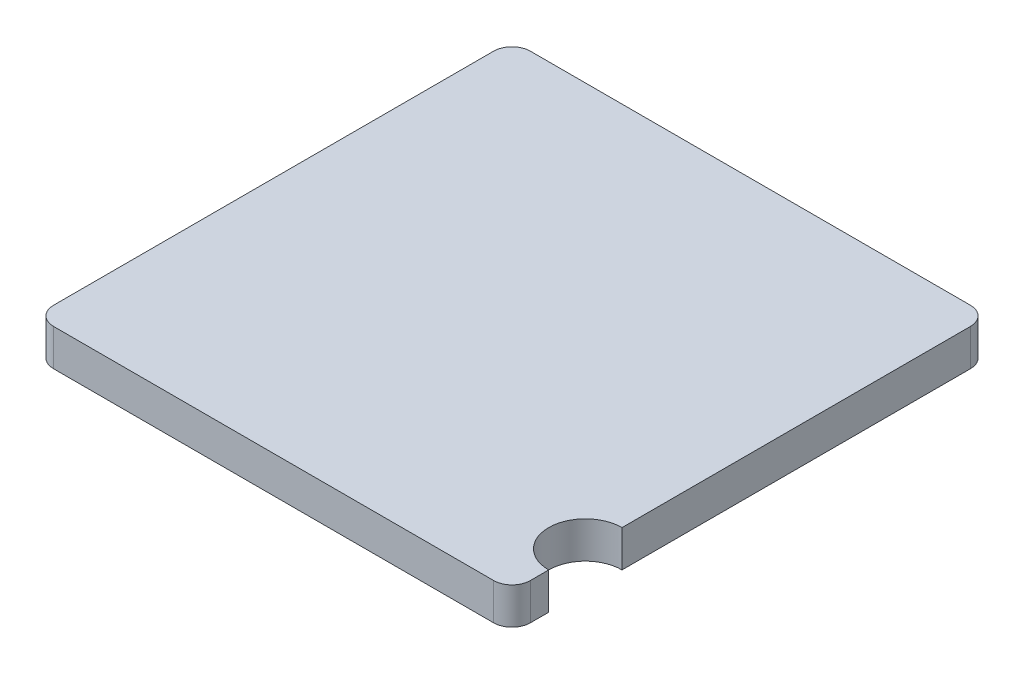
ISO-10303-21;
HEADER;
FILE_DESCRIPTION(('STEP AP214'),'2;1');
FILE_NAME('part.step','',(''),(''),'','','');
FILE_SCHEMA(('AUTOMOTIVE_DESIGN { 1 0 10303 214 1 1 1 1 }'));
ENDSEC;
DATA;
#1=APPLICATION_CONTEXT('core data for automotive mechanical design processes');
#2=APPLICATION_PROTOCOL_DEFINITION('international standard','automotive_design',2000,#1);
#3=PRODUCT_CONTEXT('',#1,'mechanical');
#4=PRODUCT('Part','Part','',(#3));
#5=PRODUCT_RELATED_PRODUCT_CATEGORY('part','',(#4));
#6=PRODUCT_DEFINITION_FORMATION('','',#4);
#7=PRODUCT_DEFINITION_CONTEXT('part definition',#1,'design');
#8=PRODUCT_DEFINITION('design','',#6,#7);
#9=PRODUCT_DEFINITION_SHAPE('','',#8);
#10=(LENGTH_UNIT() NAMED_UNIT(*) SI_UNIT(.MILLI.,.METRE.));
#11=(NAMED_UNIT(*) PLANE_ANGLE_UNIT() SI_UNIT($,.RADIAN.));
#12=(NAMED_UNIT(*) SI_UNIT($,.STERADIAN.) SOLID_ANGLE_UNIT());
#13=UNCERTAINTY_MEASURE_WITH_UNIT(LENGTH_MEASURE(1.E-05),#10,'distance_accuracy_value','');
#14=(GEOMETRIC_REPRESENTATION_CONTEXT(3) GLOBAL_UNCERTAINTY_ASSIGNED_CONTEXT((#13)) GLOBAL_UNIT_ASSIGNED_CONTEXT((#10,
#11,#12)) REPRESENTATION_CONTEXT('',''));
#15=CARTESIAN_POINT('',(0.,0.,0.));
#16=DIRECTION('',(0.,0.,1.));
#17=DIRECTION('',(1.,0.,0.));
#18=AXIS2_PLACEMENT_3D('',#15,#16,#17);
#19=CARTESIAN_POINT('',(1.3,0.2,-1.3));
#20=DIRECTION('',(-1.,0.,0.));
#21=DIRECTION('',(0.,0.,1.));
#22=AXIS2_PLACEMENT_3D('',#19,#20,#21);
#23=PLANE('',#22);
#24=DIRECTION('',(0.,0.,-1.));
#25=VECTOR('',#24,1.);
#26=CARTESIAN_POINT('',(1.3,0.2,-1.3));
#27=LINE('',#26,#25);
#28=CARTESIAN_POINT('',(1.3,0.2,0.7));
#29=VERTEX_POINT('',#28);
#30=CARTESIAN_POINT('',(1.3,0.2,-1.2));
#31=VERTEX_POINT('',#30);
#32=EDGE_CURVE('E128',#29,#31,#27,.T.);
#33=ORIENTED_EDGE('',*,*,#32,.F.);
#34=DIRECTION('',(0.,-1.,0.));
#35=VECTOR('',#34,1.);
#36=CARTESIAN_POINT('',(1.3,0.2,0.7));
#37=LINE('',#36,#35);
#38=CARTESIAN_POINT('',(1.3,0.,0.7));
#39=VERTEX_POINT('',#38);
#40=EDGE_CURVE('E115',#29,#39,#37,.T.);
#41=ORIENTED_EDGE('',*,*,#40,.T.);
#42=DIRECTION('',(0.,0.,-1.));
#43=VECTOR('',#42,1.);
#44=CARTESIAN_POINT('',(1.3,0.,-1.3));
#45=LINE('',#44,#43);
#46=CARTESIAN_POINT('',(1.3,0.,-1.2));
#47=VERTEX_POINT('',#46);
#48=EDGE_CURVE('E123',#39,#47,#45,.T.);
#49=ORIENTED_EDGE('',*,*,#48,.T.);
#50=DIRECTION('',(0.,-1.,0.));
#51=VECTOR('',#50,1.);
#52=CARTESIAN_POINT('',(1.3,0.2,-1.2));
#53=LINE('',#52,#51);
#54=EDGE_CURVE('E135',#47,#31,#53,.F.);
#55=ORIENTED_EDGE('',*,*,#54,.T.);
#56=EDGE_LOOP('',(#33,#41,#49,#55));
#57=FACE_BOUND('',#56,.T.);
#58=ADVANCED_FACE('F39',(#57),#23,.F.);
#59=CARTESIAN_POINT('',(1.3,0.,1.2));
#60=VERTEX_POINT('',#59);
#61=CARTESIAN_POINT('',(1.3,0.,1.1));
#62=VERTEX_POINT('',#61);
#63=EDGE_CURVE('E158',#60,#62,#45,.T.);
#64=ORIENTED_EDGE('',*,*,#63,.T.);
#65=DIRECTION('',(0.,-1.,0.));
#66=VECTOR('',#65,1.);
#67=CARTESIAN_POINT('',(1.3,0.2,1.1));
#68=LINE('',#67,#66);
#69=CARTESIAN_POINT('',(1.3,0.2,1.1));
#70=VERTEX_POINT('',#69);
#71=EDGE_CURVE('E55',#62,#70,#68,.F.);
#72=ORIENTED_EDGE('',*,*,#71,.T.);
#73=CARTESIAN_POINT('',(1.3,0.2,1.2));
#74=VERTEX_POINT('',#73);
#75=EDGE_CURVE('E131',#74,#70,#27,.T.);
#76=ORIENTED_EDGE('',*,*,#75,.F.);
#77=DIRECTION('',(0.,-1.,0.));
#78=VECTOR('',#77,1.);
#79=CARTESIAN_POINT('',(1.3,0.2,1.2));
#80=LINE('',#79,#78);
#81=EDGE_CURVE('E207',#74,#60,#80,.T.);
#82=ORIENTED_EDGE('',*,*,#81,.T.);
#83=EDGE_LOOP('',(#64,#72,#76,#82));
#84=FACE_BOUND('',#83,.T.);
#85=ADVANCED_FACE('F231',(#84),#23,.F.);
#86=CARTESIAN_POINT('',(-1.3,0.2,-1.3));
#87=DIRECTION('',(0.,0.,1.));
#88=DIRECTION('',(1.,0.,0.));
#89=AXIS2_PLACEMENT_3D('',#86,#87,#88);
#90=PLANE('',#89);
#91=DIRECTION('',(-1.,0.,0.));
#92=VECTOR('',#91,1.);
#93=CARTESIAN_POINT('',(-1.3,0.,-1.3));
#94=LINE('',#93,#92);
#95=CARTESIAN_POINT('',(1.2,0.,-1.3));
#96=VERTEX_POINT('',#95);
#97=CARTESIAN_POINT('',(-1.2,0.,-1.3));
#98=VERTEX_POINT('',#97);
#99=EDGE_CURVE('E162',#96,#98,#94,.T.);
#100=ORIENTED_EDGE('',*,*,#99,.T.);
#101=DIRECTION('',(0.,-1.,0.));
#102=VECTOR('',#101,1.);
#103=CARTESIAN_POINT('',(-1.2,0.2,-1.3));
#104=LINE('',#103,#102);
#105=CARTESIAN_POINT('',(-1.2,0.2,-1.3));
#106=VERTEX_POINT('',#105);
#107=EDGE_CURVE('E192',#98,#106,#104,.F.);
#108=ORIENTED_EDGE('',*,*,#107,.T.);
#109=DIRECTION('',(-1.,0.,0.));
#110=VECTOR('',#109,1.);
#111=CARTESIAN_POINT('',(-1.3,0.2,-1.3));
#112=LINE('',#111,#110);
#113=CARTESIAN_POINT('',(1.2,0.2,-1.3));
#114=VERTEX_POINT('',#113);
#115=EDGE_CURVE('E142',#114,#106,#112,.T.);
#116=ORIENTED_EDGE('',*,*,#115,.F.);
#117=DIRECTION('',(0.,-1.,0.));
#118=VECTOR('',#117,1.);
#119=CARTESIAN_POINT('',(1.2,0.2,-1.3));
#120=LINE('',#119,#118);
#121=EDGE_CURVE('E188',#114,#96,#120,.T.);
#122=ORIENTED_EDGE('',*,*,#121,.T.);
#123=EDGE_LOOP('',(#100,#108,#116,#122));
#124=FACE_BOUND('',#123,.T.);
#125=ADVANCED_FACE('F241',(#124),#90,.F.);
#126=CARTESIAN_POINT('',(-1.3,0.2,-1.3));
#127=DIRECTION('',(1.,0.,0.));
#128=DIRECTION('',(0.,0.,-1.));
#129=AXIS2_PLACEMENT_3D('',#126,#127,#128);
#130=PLANE('',#129);
#131=DIRECTION('',(0.,0.,1.));
#132=VECTOR('',#131,1.);
#133=CARTESIAN_POINT('',(-1.3,0.2,-1.3));
#134=LINE('',#133,#132);
#135=CARTESIAN_POINT('',(-1.3,0.2,-1.2));
#136=VERTEX_POINT('',#135);
#137=CARTESIAN_POINT('',(-1.3,0.2,1.2));
#138=VERTEX_POINT('',#137);
#139=EDGE_CURVE('E150',#136,#138,#134,.T.);
#140=ORIENTED_EDGE('',*,*,#139,.F.);
#141=DIRECTION('',(0.,-1.,0.));
#142=VECTOR('',#141,1.);
#143=CARTESIAN_POINT('',(-1.3,0.2,-1.2));
#144=LINE('',#143,#142);
#145=CARTESIAN_POINT('',(-1.3,0.,-1.2));
#146=VERTEX_POINT('',#145);
#147=EDGE_CURVE('E171',#136,#146,#144,.T.);
#148=ORIENTED_EDGE('',*,*,#147,.T.);
#149=DIRECTION('',(0.,0.,1.));
#150=VECTOR('',#149,1.);
#151=CARTESIAN_POINT('',(-1.3,0.,-1.3));
#152=LINE('',#151,#150);
#153=CARTESIAN_POINT('',(-1.3,0.,1.2));
#154=VERTEX_POINT('',#153);
#155=EDGE_CURVE('E143',#146,#154,#152,.T.);
#156=ORIENTED_EDGE('',*,*,#155,.T.);
#157=DIRECTION('',(0.,-1.,0.));
#158=VECTOR('',#157,1.);
#159=CARTESIAN_POINT('',(-1.3,0.2,1.2));
#160=LINE('',#159,#158);
#161=EDGE_CURVE('E157',#154,#138,#160,.F.);
#162=ORIENTED_EDGE('',*,*,#161,.T.);
#163=EDGE_LOOP('',(#140,#148,#156,#162));
#164=FACE_BOUND('',#163,.T.);
#165=ADVANCED_FACE('F248',(#164),#130,.F.);
#166=CARTESIAN_POINT('',(-1.3,0.2,1.3));
#167=DIRECTION('',(0.,0.,-1.));
#168=DIRECTION('',(-1.,0.,0.));
#169=AXIS2_PLACEMENT_3D('',#166,#167,#168);
#170=PLANE('',#169);
#171=DIRECTION('',(1.,0.,0.));
#172=VECTOR('',#171,1.);
#173=CARTESIAN_POINT('',(-1.3,0.,1.3));
#174=LINE('',#173,#172);
#175=CARTESIAN_POINT('',(-1.2,0.,1.3));
#176=VERTEX_POINT('',#175);
#177=CARTESIAN_POINT('',(1.2,0.,1.3));
#178=VERTEX_POINT('',#177);
#179=EDGE_CURVE('E138',#176,#178,#174,.T.);
#180=ORIENTED_EDGE('',*,*,#179,.T.);
#181=DIRECTION('',(0.,-1.,0.));
#182=VECTOR('',#181,1.);
#183=CARTESIAN_POINT('',(1.2,0.2,1.3));
#184=LINE('',#183,#182);
#185=CARTESIAN_POINT('',(1.2,0.2,1.3));
#186=VERTEX_POINT('',#185);
#187=EDGE_CURVE('E48',#178,#186,#184,.F.);
#188=ORIENTED_EDGE('',*,*,#187,.T.);
#189=DIRECTION('',(1.,0.,0.));
#190=VECTOR('',#189,1.);
#191=CARTESIAN_POINT('',(-1.3,0.2,1.3));
#192=LINE('',#191,#190);
#193=CARTESIAN_POINT('',(-1.2,0.2,1.3));
#194=VERTEX_POINT('',#193);
#195=EDGE_CURVE('E154',#194,#186,#192,.T.);
#196=ORIENTED_EDGE('',*,*,#195,.F.);
#197=DIRECTION('',(0.,-1.,0.));
#198=VECTOR('',#197,1.);
#199=CARTESIAN_POINT('',(-1.2,0.2,1.3));
#200=LINE('',#199,#198);
#201=EDGE_CURVE('E213',#194,#176,#200,.T.);
#202=ORIENTED_EDGE('',*,*,#201,.T.);
#203=EDGE_LOOP('',(#180,#188,#196,#202));
#204=FACE_BOUND('',#203,.T.);
#205=ADVANCED_FACE('F219',(#204),#170,.F.);
#206=CARTESIAN_POINT('',(0.,0.2,0.));
#207=DIRECTION('',(0.,1.,0.));
#208=DIRECTION('',(0.,0.,1.));
#209=AXIS2_PLACEMENT_3D('',#206,#207,#208);
#210=PLANE('',#209);
#211=CARTESIAN_POINT('',(1.3,0.2,0.9));
#212=DIRECTION('',(0.,-1.,0.));
#213=DIRECTION('',(0.,0.,-1.));
#214=AXIS2_PLACEMENT_3D('',#211,#212,#213);
#215=CIRCLE('',#214,0.2);
#216=EDGE_CURVE('E118',#70,#29,#215,.T.);
#217=ORIENTED_EDGE('',*,*,#216,.T.);
#218=ORIENTED_EDGE('',*,*,#32,.T.);
#219=CARTESIAN_POINT('',(1.2,0.2,-1.2));
#220=DIRECTION('',(0.,1.,0.));
#221=DIRECTION('',(0.,0.,1.));
#222=AXIS2_PLACEMENT_3D('',#219,#220,#221);
#223=CIRCLE('',#222,0.1);
#224=EDGE_CURVE('E201',#31,#114,#223,.T.);
#225=ORIENTED_EDGE('',*,*,#224,.T.);
#226=ORIENTED_EDGE('',*,*,#115,.T.);
#227=CARTESIAN_POINT('',(-1.2,0.2,-1.2));
#228=DIRECTION('',(0.,1.,0.));
#229=DIRECTION('',(0.,0.,1.));
#230=AXIS2_PLACEMENT_3D('',#227,#228,#229);
#231=CIRCLE('',#230,0.1);
#232=EDGE_CURVE('E204',#106,#136,#231,.T.);
#233=ORIENTED_EDGE('',*,*,#232,.T.);
#234=ORIENTED_EDGE('',*,*,#139,.T.);
#235=CARTESIAN_POINT('',(-1.2,0.2,1.2));
#236=DIRECTION('',(0.,1.,0.));
#237=DIRECTION('',(0.,0.,1.));
#238=AXIS2_PLACEMENT_3D('',#235,#236,#237);
#239=CIRCLE('',#238,0.1);
#240=EDGE_CURVE('E195',#138,#194,#239,.T.);
#241=ORIENTED_EDGE('',*,*,#240,.T.);
#242=ORIENTED_EDGE('',*,*,#195,.T.);
#243=CARTESIAN_POINT('',(1.2,0.2,1.2));
#244=DIRECTION('',(0.,1.,0.));
#245=DIRECTION('',(0.,0.,1.));
#246=AXIS2_PLACEMENT_3D('',#243,#244,#245);
#247=CIRCLE('',#246,0.1);
#248=EDGE_CURVE('E198',#186,#74,#247,.T.);
#249=ORIENTED_EDGE('',*,*,#248,.T.);
#250=ORIENTED_EDGE('',*,*,#75,.T.);
#251=EDGE_LOOP('',(#217,#218,#225,#226,#233,#234,#241,#242,#249,#250));
#252=FACE_BOUND('',#251,.T.);
#253=ADVANCED_FACE('F127',(#252),#210,.T.);
#254=CARTESIAN_POINT('',(0.,0.,0.));
#255=DIRECTION('',(0.,1.,0.));
#256=DIRECTION('',(0.,0.,1.));
#257=AXIS2_PLACEMENT_3D('',#254,#255,#256);
#258=PLANE('',#257);
#259=ORIENTED_EDGE('',*,*,#48,.F.);
#260=CARTESIAN_POINT('',(1.3,0.,0.9));
#261=DIRECTION('',(0.,1.,0.));
#262=DIRECTION('',(0.,0.,1.));
#263=AXIS2_PLACEMENT_3D('',#260,#261,#262);
#264=CIRCLE('',#263,0.2);
#265=EDGE_CURVE('E11',#39,#62,#264,.T.);
#266=ORIENTED_EDGE('',*,*,#265,.T.);
#267=ORIENTED_EDGE('',*,*,#63,.F.);
#268=CARTESIAN_POINT('',(1.2,0.,1.2));
#269=DIRECTION('',(0.,1.,0.));
#270=DIRECTION('',(0.,0.,1.));
#271=AXIS2_PLACEMENT_3D('',#268,#269,#270);
#272=CIRCLE('',#271,0.1);
#273=EDGE_CURVE('E178',#60,#178,#272,.F.);
#274=ORIENTED_EDGE('',*,*,#273,.T.);
#275=ORIENTED_EDGE('',*,*,#179,.F.);
#276=CARTESIAN_POINT('',(-1.2,0.,1.2));
#277=DIRECTION('',(0.,1.,0.));
#278=DIRECTION('',(0.,0.,1.));
#279=AXIS2_PLACEMENT_3D('',#276,#277,#278);
#280=CIRCLE('',#279,0.1);
#281=EDGE_CURVE('E175',#176,#154,#280,.F.);
#282=ORIENTED_EDGE('',*,*,#281,.T.);
#283=ORIENTED_EDGE('',*,*,#155,.F.);
#284=CARTESIAN_POINT('',(-1.2,0.,-1.2));
#285=DIRECTION('',(0.,1.,0.));
#286=DIRECTION('',(0.,0.,1.));
#287=AXIS2_PLACEMENT_3D('',#284,#285,#286);
#288=CIRCLE('',#287,0.1);
#289=EDGE_CURVE('E185',#146,#98,#288,.F.);
#290=ORIENTED_EDGE('',*,*,#289,.T.);
#291=ORIENTED_EDGE('',*,*,#99,.F.);
#292=CARTESIAN_POINT('',(1.2,0.,-1.2));
#293=DIRECTION('',(0.,1.,0.));
#294=DIRECTION('',(0.,0.,1.));
#295=AXIS2_PLACEMENT_3D('',#292,#293,#294);
#296=CIRCLE('',#295,0.1);
#297=EDGE_CURVE('E181',#96,#47,#296,.F.);
#298=ORIENTED_EDGE('',*,*,#297,.T.);
#299=EDGE_LOOP('',(#259,#266,#267,#274,#275,#282,#283,#290,#291,#298));
#300=FACE_BOUND('',#299,.T.);
#301=ADVANCED_FACE('F223',(#300),#258,.F.);
#302=CARTESIAN_POINT('',(-1.2,0.2,-1.2));
#303=DIRECTION('',(0.,-1.,0.));
#304=DIRECTION('',(0.,0.,-1.));
#305=AXIS2_PLACEMENT_3D('',#302,#303,#304);
#306=CYLINDRICAL_SURFACE('',#305,0.1);
#307=ORIENTED_EDGE('',*,*,#232,.F.);
#308=ORIENTED_EDGE('',*,*,#107,.F.);
#309=ORIENTED_EDGE('',*,*,#289,.F.);
#310=ORIENTED_EDGE('',*,*,#147,.F.);
#311=EDGE_LOOP('',(#307,#308,#309,#310));
#312=FACE_BOUND('',#311,.T.);
#313=ADVANCED_FACE('F244',(#312),#306,.T.);
#314=CARTESIAN_POINT('',(1.2,0.2,-1.2));
#315=DIRECTION('',(0.,-1.,0.));
#316=DIRECTION('',(0.,0.,-1.));
#317=AXIS2_PLACEMENT_3D('',#314,#315,#316);
#318=CYLINDRICAL_SURFACE('',#317,0.1);
#319=ORIENTED_EDGE('',*,*,#224,.F.);
#320=ORIENTED_EDGE('',*,*,#54,.F.);
#321=ORIENTED_EDGE('',*,*,#297,.F.);
#322=ORIENTED_EDGE('',*,*,#121,.F.);
#323=EDGE_LOOP('',(#319,#320,#321,#322));
#324=FACE_BOUND('',#323,.T.);
#325=ADVANCED_FACE('F237',(#324),#318,.T.);
#326=CARTESIAN_POINT('',(1.2,0.2,1.2));
#327=DIRECTION('',(0.,-1.,0.));
#328=DIRECTION('',(0.,0.,-1.));
#329=AXIS2_PLACEMENT_3D('',#326,#327,#328);
#330=CYLINDRICAL_SURFACE('',#329,0.1);
#331=ORIENTED_EDGE('',*,*,#248,.F.);
#332=ORIENTED_EDGE('',*,*,#187,.F.);
#333=ORIENTED_EDGE('',*,*,#273,.F.);
#334=ORIENTED_EDGE('',*,*,#81,.F.);
#335=EDGE_LOOP('',(#331,#332,#333,#334));
#336=FACE_BOUND('',#335,.T.);
#337=ADVANCED_FACE('F229',(#336),#330,.T.);
#338=CARTESIAN_POINT('',(-1.2,0.2,1.2));
#339=DIRECTION('',(0.,-1.,0.));
#340=DIRECTION('',(0.,0.,-1.));
#341=AXIS2_PLACEMENT_3D('',#338,#339,#340);
#342=CYLINDRICAL_SURFACE('',#341,0.1);
#343=ORIENTED_EDGE('',*,*,#240,.F.);
#344=ORIENTED_EDGE('',*,*,#161,.F.);
#345=ORIENTED_EDGE('',*,*,#281,.F.);
#346=ORIENTED_EDGE('',*,*,#201,.F.);
#347=EDGE_LOOP('',(#343,#344,#345,#346));
#348=FACE_BOUND('',#347,.T.);
#349=ADVANCED_FACE('F41',(#348),#342,.T.);
#350=CARTESIAN_POINT('',(1.3,0.2,0.9));
#351=DIRECTION('',(0.,-1.,0.));
#352=DIRECTION('',(0.,0.,-1.));
#353=AXIS2_PLACEMENT_3D('',#350,#351,#352);
#354=CYLINDRICAL_SURFACE('',#353,0.2);
#355=ORIENTED_EDGE('',*,*,#216,.F.);
#356=ORIENTED_EDGE('',*,*,#71,.F.);
#357=ORIENTED_EDGE('',*,*,#265,.F.);
#358=ORIENTED_EDGE('',*,*,#40,.F.);
#359=EDGE_LOOP('',(#355,#356,#357,#358));
#360=FACE_BOUND('',#359,.T.);
#361=ADVANCED_FACE('F117',(#360),#354,.F.);
#362=CLOSED_SHELL('',(#58,#85,#125,#165,#205,#253,#301,#313,#325,#337,#349,#361));
#363=MANIFOLD_SOLID_BREP('B2',#362);
#364=ADVANCED_BREP_SHAPE_REPRESENTATION('',(#18,#363),#14);
#365=SHAPE_DEFINITION_REPRESENTATION(#9,#364);
ENDSEC;
END-ISO-10303-21;
